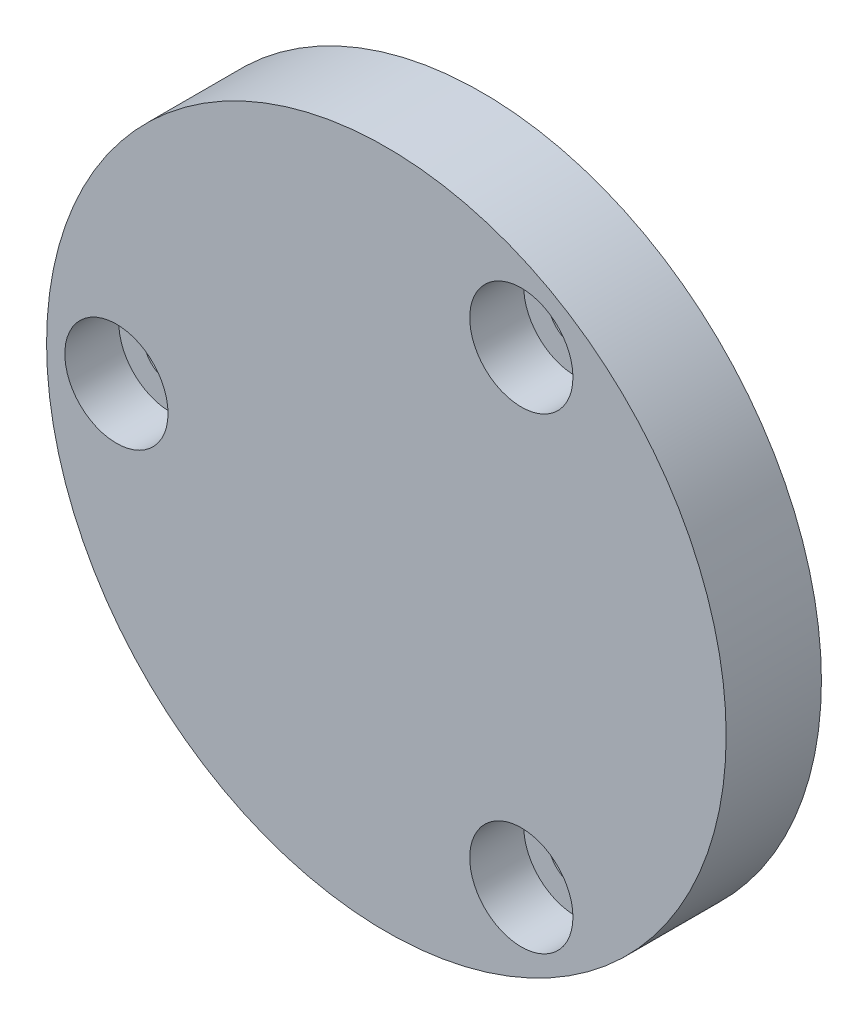
ISO-10303-21;
HEADER;
FILE_DESCRIPTION(('STEP AP214'),'2;1');
FILE_NAME('part.step','',(''),(''),'','','');
FILE_SCHEMA(('AUTOMOTIVE_DESIGN { 1 0 10303 214 1 1 1 1 }'));
ENDSEC;
DATA;
#1=APPLICATION_CONTEXT('core data for automotive mechanical design processes');
#2=APPLICATION_PROTOCOL_DEFINITION('international standard','automotive_design',2000,#1);
#3=PRODUCT_CONTEXT('',#1,'mechanical');
#4=PRODUCT('Part','Part','',(#3));
#5=PRODUCT_RELATED_PRODUCT_CATEGORY('part','',(#4));
#6=PRODUCT_DEFINITION_FORMATION('','',#4);
#7=PRODUCT_DEFINITION_CONTEXT('part definition',#1,'design');
#8=PRODUCT_DEFINITION('design','',#6,#7);
#9=PRODUCT_DEFINITION_SHAPE('','',#8);
#10=(LENGTH_UNIT() NAMED_UNIT(*) SI_UNIT(.MILLI.,.METRE.));
#11=(NAMED_UNIT(*) PLANE_ANGLE_UNIT() SI_UNIT($,.RADIAN.));
#12=(NAMED_UNIT(*) SI_UNIT($,.STERADIAN.) SOLID_ANGLE_UNIT());
#13=UNCERTAINTY_MEASURE_WITH_UNIT(LENGTH_MEASURE(1.E-05),#10,'distance_accuracy_value','');
#14=(GEOMETRIC_REPRESENTATION_CONTEXT(3) GLOBAL_UNCERTAINTY_ASSIGNED_CONTEXT((#13)) GLOBAL_UNIT_ASSIGNED_CONTEXT((#10,
#11,#12)) REPRESENTATION_CONTEXT('',''));
#15=CARTESIAN_POINT('',(0.,0.,0.));
#16=DIRECTION('',(0.,0.,1.));
#17=DIRECTION('',(1.,0.,0.));
#18=AXIS2_PLACEMENT_3D('',#15,#16,#17);
#19=CARTESIAN_POINT('',(0.,0.,6.));
#20=DIRECTION('',(0.,0.,-1.));
#21=DIRECTION('',(-1.,0.,0.));
#22=AXIS2_PLACEMENT_3D('',#19,#20,#21);
#23=CYLINDRICAL_SURFACE('',#22,21.4);
#24=CARTESIAN_POINT('',(0.,0.,6.));
#25=DIRECTION('',(0.,0.,1.));
#26=DIRECTION('',(1.,0.,0.));
#27=AXIS2_PLACEMENT_3D('',#24,#25,#26);
#28=CIRCLE('',#27,21.4);
#29=CARTESIAN_POINT('',(21.4,0.,6.));
#30=VERTEX_POINT('',#29);
#31=EDGE_CURVE('E10',#30,#30,#28,.T.);
#32=ORIENTED_EDGE('',*,*,#31,.F.);
#33=EDGE_LOOP('',(#32));
#34=FACE_BOUND('',#33,.T.);
#35=CARTESIAN_POINT('',(0.,0.,0.));
#36=DIRECTION('',(0.,0.,1.));
#37=DIRECTION('',(1.,0.,0.));
#38=AXIS2_PLACEMENT_3D('',#35,#36,#37);
#39=CIRCLE('',#38,21.4);
#40=CARTESIAN_POINT('',(21.4,0.,0.));
#41=VERTEX_POINT('',#40);
#42=EDGE_CURVE('E38',#41,#41,#39,.T.);
#43=ORIENTED_EDGE('',*,*,#42,.T.);
#44=EDGE_LOOP('',(#43));
#45=FACE_BOUND('',#44,.T.);
#46=ADVANCED_FACE('F31',(#34,#45),#23,.T.);
#47=CARTESIAN_POINT('',(0.,0.,6.));
#48=DIRECTION('',(0.,0.,1.));
#49=DIRECTION('',(1.,0.,0.));
#50=AXIS2_PLACEMENT_3D('',#47,#48,#49);
#51=PLANE('',#50);
#52=CARTESIAN_POINT('',(-17.,0.,6.));
#53=DIRECTION('',(0.,0.,1.));
#54=DIRECTION('',(1.,0.,0.));
#55=AXIS2_PLACEMENT_3D('',#52,#53,#54);
#56=CIRCLE('',#55,3.25);
#57=CARTESIAN_POINT('',(-13.75,0.,6.));
#58=VERTEX_POINT('',#57);
#59=EDGE_CURVE('E148',#58,#58,#56,.T.);
#60=ORIENTED_EDGE('',*,*,#59,.F.);
#61=EDGE_LOOP('',(#60));
#62=FACE_BOUND('',#61,.T.);
#63=CARTESIAN_POINT('',(8.50000000000007,14.7224318643354,6.));
#64=DIRECTION('',(0.,0.,1.));
#65=DIRECTION('',(1.,0.,0.));
#66=AXIS2_PLACEMENT_3D('',#63,#64,#65);
#67=CIRCLE('',#66,3.25);
#68=CARTESIAN_POINT('',(11.7500000000001,14.7224318643354,6.));
#69=VERTEX_POINT('',#68);
#70=EDGE_CURVE('E67',#69,#69,#67,.T.);
#71=ORIENTED_EDGE('',*,*,#70,.F.);
#72=EDGE_LOOP('',(#71));
#73=FACE_BOUND('',#72,.T.);
#74=CARTESIAN_POINT('',(8.49999999999986,-14.7224318643355,6.));
#75=DIRECTION('',(0.,0.,1.));
#76=DIRECTION('',(1.,0.,0.));
#77=AXIS2_PLACEMENT_3D('',#74,#75,#76);
#78=CIRCLE('',#77,3.25);
#79=CARTESIAN_POINT('',(11.7499999999999,-14.7224318643355,6.));
#80=VERTEX_POINT('',#79);
#81=EDGE_CURVE('E54',#80,#80,#78,.T.);
#82=ORIENTED_EDGE('',*,*,#81,.F.);
#83=EDGE_LOOP('',(#82));
#84=FACE_BOUND('',#83,.T.);
#85=ORIENTED_EDGE('',*,*,#31,.T.);
#86=EDGE_LOOP('',(#85));
#87=FACE_BOUND('',#86,.T.);
#88=ADVANCED_FACE('F85',(#62,#73,#84,#87),#51,.T.);
#89=CARTESIAN_POINT('',(0.,0.,0.));
#90=DIRECTION('',(0.,0.,1.));
#91=DIRECTION('',(1.,0.,0.));
#92=AXIS2_PLACEMENT_3D('',#89,#90,#91);
#93=PLANE('',#92);
#94=CARTESIAN_POINT('',(-17.,0.,0.));
#95=DIRECTION('',(0.,0.,1.));
#96=DIRECTION('',(1.,0.,0.));
#97=AXIS2_PLACEMENT_3D('',#94,#95,#96);
#98=CIRCLE('',#97,1.7);
#99=CARTESIAN_POINT('',(-15.3,0.,0.));
#100=VERTEX_POINT('',#99);
#101=EDGE_CURVE('E34',#100,#100,#98,.T.);
#102=ORIENTED_EDGE('',*,*,#101,.T.);
#103=EDGE_LOOP('',(#102));
#104=FACE_BOUND('',#103,.T.);
#105=CARTESIAN_POINT('',(8.50000000000007,14.7224318643354,0.));
#106=DIRECTION('',(0.,0.,1.));
#107=DIRECTION('',(1.,0.,0.));
#108=AXIS2_PLACEMENT_3D('',#105,#106,#107);
#109=CIRCLE('',#108,1.7);
#110=CARTESIAN_POINT('',(10.2000000000001,14.7224318643354,0.));
#111=VERTEX_POINT('',#110);
#112=EDGE_CURVE('E52',#111,#111,#109,.T.);
#113=ORIENTED_EDGE('',*,*,#112,.T.);
#114=EDGE_LOOP('',(#113));
#115=FACE_BOUND('',#114,.T.);
#116=CARTESIAN_POINT('',(8.49999999999986,-14.7224318643355,0.));
#117=DIRECTION('',(0.,0.,1.));
#118=DIRECTION('',(1.,0.,0.));
#119=AXIS2_PLACEMENT_3D('',#116,#117,#118);
#120=CIRCLE('',#119,1.7);
#121=CARTESIAN_POINT('',(10.1999999999999,-14.7224318643355,0.));
#122=VERTEX_POINT('',#121);
#123=EDGE_CURVE('E49',#122,#122,#120,.T.);
#124=ORIENTED_EDGE('',*,*,#123,.T.);
#125=EDGE_LOOP('',(#124));
#126=FACE_BOUND('',#125,.T.);
#127=CARTESIAN_POINT('',(0.,0.,0.));
#128=DIRECTION('',(0.,0.,-1.));
#129=DIRECTION('',(-1.,0.,0.));
#130=AXIS2_PLACEMENT_3D('',#127,#128,#129);
#131=CIRCLE('',#130,12.5);
#132=CARTESIAN_POINT('',(-12.5,0.,0.));
#133=VERTEX_POINT('',#132);
#134=EDGE_CURVE('E46',#133,#133,#131,.T.);
#135=ORIENTED_EDGE('',*,*,#134,.F.);
#136=EDGE_LOOP('',(#135));
#137=FACE_BOUND('',#136,.T.);
#138=ORIENTED_EDGE('',*,*,#42,.F.);
#139=EDGE_LOOP('',(#138));
#140=FACE_BOUND('',#139,.T.);
#141=ADVANCED_FACE('F82',(#104,#115,#126,#137,#140),#93,.F.);
#142=CARTESIAN_POINT('',(0.,0.,3.));
#143=DIRECTION('',(0.,0.,-1.));
#144=DIRECTION('',(-1.,0.,0.));
#145=AXIS2_PLACEMENT_3D('',#142,#143,#144);
#146=CYLINDRICAL_SURFACE('',#145,12.5);
#147=CARTESIAN_POINT('',(0.,0.,3.));
#148=DIRECTION('',(0.,0.,-1.));
#149=DIRECTION('',(-1.,0.,0.));
#150=AXIS2_PLACEMENT_3D('',#147,#148,#149);
#151=CIRCLE('',#150,12.5);
#152=CARTESIAN_POINT('',(-12.5,0.,3.));
#153=VERTEX_POINT('',#152);
#154=EDGE_CURVE('E43',#153,#153,#151,.T.);
#155=ORIENTED_EDGE('',*,*,#154,.F.);
#156=EDGE_LOOP('',(#155));
#157=FACE_BOUND('',#156,.T.);
#158=ORIENTED_EDGE('',*,*,#134,.T.);
#159=EDGE_LOOP('',(#158));
#160=FACE_BOUND('',#159,.T.);
#161=ADVANCED_FACE('F80',(#157,#160),#146,.F.);
#162=CARTESIAN_POINT('',(0.,0.,3.));
#163=DIRECTION('',(0.,0.,-1.));
#164=DIRECTION('',(-1.,0.,0.));
#165=AXIS2_PLACEMENT_3D('',#162,#163,#164);
#166=PLANE('',#165);
#167=ORIENTED_EDGE('',*,*,#154,.T.);
#168=EDGE_LOOP('',(#167));
#169=FACE_BOUND('',#168,.T.);
#170=ADVANCED_FACE('F103',(#169),#166,.T.);
#171=CARTESIAN_POINT('',(8.49999999999986,-14.7224318643355,6.));
#172=DIRECTION('',(0.,0.,1.));
#173=DIRECTION('',(1.,0.,0.));
#174=AXIS2_PLACEMENT_3D('',#171,#172,#173);
#175=CYLINDRICAL_SURFACE('',#174,1.7);
#176=CARTESIAN_POINT('',(8.49999999999986,-14.7224318643355,2.6));
#177=DIRECTION('',(0.,0.,1.));
#178=DIRECTION('',(1.,0.,0.));
#179=AXIS2_PLACEMENT_3D('',#176,#177,#178);
#180=CIRCLE('',#179,1.7);
#181=CARTESIAN_POINT('',(10.1999999999999,-14.7224318643355,2.6));
#182=VERTEX_POINT('',#181);
#183=EDGE_CURVE('E51',#182,#182,#180,.T.);
#184=ORIENTED_EDGE('',*,*,#183,.T.);
#185=EDGE_LOOP('',(#184));
#186=FACE_BOUND('',#185,.T.);
#187=ORIENTED_EDGE('',*,*,#123,.F.);
#188=EDGE_LOOP('',(#187));
#189=FACE_BOUND('',#188,.T.);
#190=ADVANCED_FACE('F107',(#186,#189),#175,.F.);
#191=CARTESIAN_POINT('',(10.1999999999999,-14.7224318643355,2.6));
#192=DIRECTION('',(0.,0.,-1.));
#193=DIRECTION('',(-1.,0.,0.));
#194=AXIS2_PLACEMENT_3D('',#191,#192,#193);
#195=PLANE('',#194);
#196=ORIENTED_EDGE('',*,*,#183,.F.);
#197=EDGE_LOOP('',(#196));
#198=FACE_BOUND('',#197,.T.);
#199=CARTESIAN_POINT('',(8.49999999999986,-14.7224318643355,2.6));
#200=DIRECTION('',(0.,0.,1.));
#201=DIRECTION('',(1.,0.,0.));
#202=AXIS2_PLACEMENT_3D('',#199,#200,#201);
#203=CIRCLE('',#202,3.25);
#204=CARTESIAN_POINT('',(11.7499999999999,-14.7224318643355,2.6));
#205=VERTEX_POINT('',#204);
#206=EDGE_CURVE('E59',#205,#205,#203,.T.);
#207=ORIENTED_EDGE('',*,*,#206,.T.);
#208=EDGE_LOOP('',(#207));
#209=FACE_BOUND('',#208,.T.);
#210=ADVANCED_FACE('F110',(#198,#209),#195,.F.);
#211=CARTESIAN_POINT('',(8.49999999999986,-14.7224318643355,6.));
#212=DIRECTION('',(0.,0.,1.));
#213=DIRECTION('',(1.,0.,0.));
#214=AXIS2_PLACEMENT_3D('',#211,#212,#213);
#215=CYLINDRICAL_SURFACE('',#214,3.25);
#216=ORIENTED_EDGE('',*,*,#206,.F.);
#217=EDGE_LOOP('',(#216));
#218=FACE_BOUND('',#217,.T.);
#219=ORIENTED_EDGE('',*,*,#81,.T.);
#220=EDGE_LOOP('',(#219));
#221=FACE_BOUND('',#220,.T.);
#222=ADVANCED_FACE('F114',(#218,#221),#215,.F.);
#223=CARTESIAN_POINT('',(8.50000000000007,14.7224318643354,6.));
#224=DIRECTION('',(0.,0.,1.));
#225=DIRECTION('',(1.,0.,0.));
#226=AXIS2_PLACEMENT_3D('',#223,#224,#225);
#227=CYLINDRICAL_SURFACE('',#226,1.7);
#228=CARTESIAN_POINT('',(8.50000000000007,14.7224318643354,2.6));
#229=DIRECTION('',(0.,0.,1.));
#230=DIRECTION('',(1.,0.,0.));
#231=AXIS2_PLACEMENT_3D('',#228,#229,#230);
#232=CIRCLE('',#231,1.7);
#233=CARTESIAN_POINT('',(10.2000000000001,14.7224318643354,2.6));
#234=VERTEX_POINT('',#233);
#235=EDGE_CURVE('E55',#234,#234,#232,.T.);
#236=ORIENTED_EDGE('',*,*,#235,.T.);
#237=EDGE_LOOP('',(#236));
#238=FACE_BOUND('',#237,.T.);
#239=ORIENTED_EDGE('',*,*,#112,.F.);
#240=EDGE_LOOP('',(#239));
#241=FACE_BOUND('',#240,.T.);
#242=ADVANCED_FACE('F118',(#238,#241),#227,.F.);
#243=CARTESIAN_POINT('',(10.2000000000001,14.7224318643354,2.6));
#244=DIRECTION('',(0.,0.,-1.));
#245=DIRECTION('',(-1.,0.,0.));
#246=AXIS2_PLACEMENT_3D('',#243,#244,#245);
#247=PLANE('',#246);
#248=ORIENTED_EDGE('',*,*,#235,.F.);
#249=EDGE_LOOP('',(#248));
#250=FACE_BOUND('',#249,.T.);
#251=CARTESIAN_POINT('',(8.50000000000007,14.7224318643354,2.6));
#252=DIRECTION('',(0.,0.,1.));
#253=DIRECTION('',(1.,0.,0.));
#254=AXIS2_PLACEMENT_3D('',#251,#252,#253);
#255=CIRCLE('',#254,3.25);
#256=CARTESIAN_POINT('',(11.7500000000001,14.7224318643354,2.6));
#257=VERTEX_POINT('',#256);
#258=EDGE_CURVE('E62',#257,#257,#255,.T.);
#259=ORIENTED_EDGE('',*,*,#258,.T.);
#260=EDGE_LOOP('',(#259));
#261=FACE_BOUND('',#260,.T.);
#262=ADVANCED_FACE('F122',(#250,#261),#247,.F.);
#263=CARTESIAN_POINT('',(8.50000000000007,14.7224318643354,6.));
#264=DIRECTION('',(0.,0.,1.));
#265=DIRECTION('',(1.,0.,0.));
#266=AXIS2_PLACEMENT_3D('',#263,#264,#265);
#267=CYLINDRICAL_SURFACE('',#266,3.25);
#268=ORIENTED_EDGE('',*,*,#258,.F.);
#269=EDGE_LOOP('',(#268));
#270=FACE_BOUND('',#269,.T.);
#271=ORIENTED_EDGE('',*,*,#70,.T.);
#272=EDGE_LOOP('',(#271));
#273=FACE_BOUND('',#272,.T.);
#274=ADVANCED_FACE('F125',(#270,#273),#267,.F.);
#275=CARTESIAN_POINT('',(-17.,0.,6.));
#276=DIRECTION('',(0.,0.,1.));
#277=DIRECTION('',(1.,0.,0.));
#278=AXIS2_PLACEMENT_3D('',#275,#276,#277);
#279=CYLINDRICAL_SURFACE('',#278,1.7);
#280=CARTESIAN_POINT('',(-17.,0.,2.6));
#281=DIRECTION('',(0.,0.,1.));
#282=DIRECTION('',(1.,0.,0.));
#283=AXIS2_PLACEMENT_3D('',#280,#281,#282);
#284=CIRCLE('',#283,1.7);
#285=CARTESIAN_POINT('',(-15.3,0.,2.6));
#286=VERTEX_POINT('',#285);
#287=EDGE_CURVE('E150',#286,#286,#284,.T.);
#288=ORIENTED_EDGE('',*,*,#287,.T.);
#289=EDGE_LOOP('',(#288));
#290=FACE_BOUND('',#289,.T.);
#291=ORIENTED_EDGE('',*,*,#101,.F.);
#292=EDGE_LOOP('',(#291));
#293=FACE_BOUND('',#292,.T.);
#294=ADVANCED_FACE('F129',(#290,#293),#279,.F.);
#295=CARTESIAN_POINT('',(-15.3,0.,2.6));
#296=DIRECTION('',(0.,0.,-1.));
#297=DIRECTION('',(-1.,0.,0.));
#298=AXIS2_PLACEMENT_3D('',#295,#296,#297);
#299=PLANE('',#298);
#300=ORIENTED_EDGE('',*,*,#287,.F.);
#301=EDGE_LOOP('',(#300));
#302=FACE_BOUND('',#301,.T.);
#303=CARTESIAN_POINT('',(-17.,0.,2.6));
#304=DIRECTION('',(0.,0.,1.));
#305=DIRECTION('',(1.,0.,0.));
#306=AXIS2_PLACEMENT_3D('',#303,#304,#305);
#307=CIRCLE('',#306,3.25);
#308=CARTESIAN_POINT('',(-13.75,0.,2.6));
#309=VERTEX_POINT('',#308);
#310=EDGE_CURVE('E146',#309,#309,#307,.T.);
#311=ORIENTED_EDGE('',*,*,#310,.T.);
#312=EDGE_LOOP('',(#311));
#313=FACE_BOUND('',#312,.T.);
#314=ADVANCED_FACE('F133',(#302,#313),#299,.F.);
#315=CARTESIAN_POINT('',(-17.,0.,6.));
#316=DIRECTION('',(0.,0.,1.));
#317=DIRECTION('',(1.,0.,0.));
#318=AXIS2_PLACEMENT_3D('',#315,#316,#317);
#319=CYLINDRICAL_SURFACE('',#318,3.25);
#320=ORIENTED_EDGE('',*,*,#310,.F.);
#321=EDGE_LOOP('',(#320));
#322=FACE_BOUND('',#321,.T.);
#323=ORIENTED_EDGE('',*,*,#59,.T.);
#324=EDGE_LOOP('',(#323));
#325=FACE_BOUND('',#324,.T.);
#326=ADVANCED_FACE('F137',(#322,#325),#319,.F.);
#327=CLOSED_SHELL('',(#46,#88,#141,#161,#170,#190,#210,#222,#242,#262,#274,#294,#314,#326));
#328=MANIFOLD_SOLID_BREP('B2',#327);
#329=ADVANCED_BREP_SHAPE_REPRESENTATION('',(#18,#328),#14);
#330=SHAPE_DEFINITION_REPRESENTATION(#9,#329);
ENDSEC;
END-ISO-10303-21;
